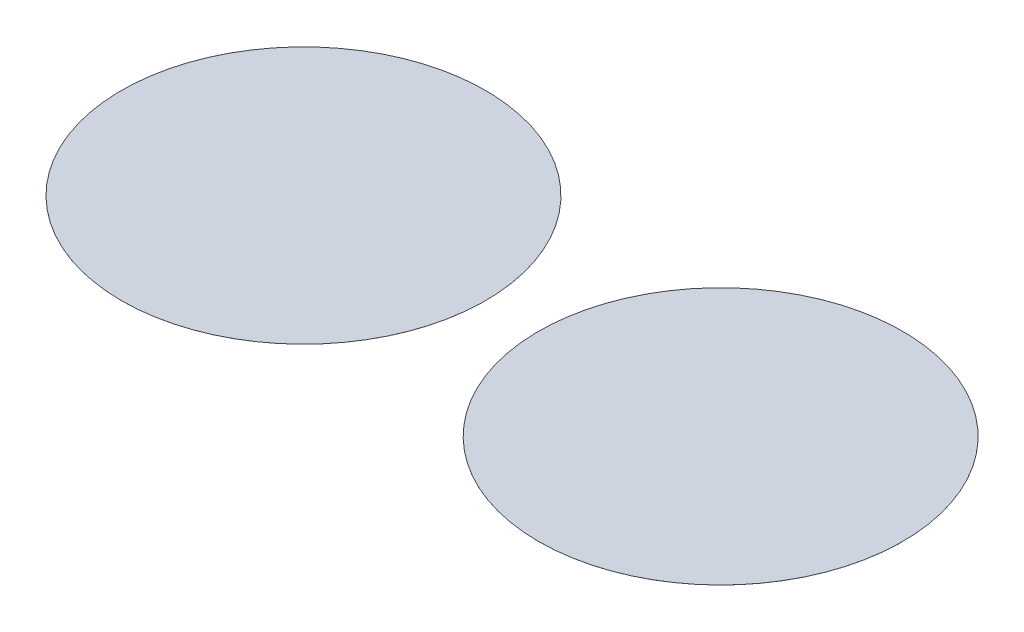
ISO-10303-21;
HEADER;
FILE_DESCRIPTION(('STEP AP214'),'2;1');
FILE_NAME('part.step','',(''),(''),'','','');
FILE_SCHEMA(('AUTOMOTIVE_DESIGN { 1 0 10303 214 1 1 1 1 }'));
ENDSEC;
DATA;
#1=APPLICATION_CONTEXT('core data for automotive mechanical design processes');
#2=APPLICATION_PROTOCOL_DEFINITION('international standard','automotive_design',2000,#1);
#3=PRODUCT_CONTEXT('',#1,'mechanical');
#4=PRODUCT('Part','Part','',(#3));
#5=PRODUCT_RELATED_PRODUCT_CATEGORY('part','',(#4));
#6=PRODUCT_DEFINITION_FORMATION('','',#4);
#7=PRODUCT_DEFINITION_CONTEXT('part definition',#1,'design');
#8=PRODUCT_DEFINITION('design','',#6,#7);
#9=PRODUCT_DEFINITION_SHAPE('','',#8);
#10=(LENGTH_UNIT() NAMED_UNIT(*) SI_UNIT(.MILLI.,.METRE.));
#11=(NAMED_UNIT(*) PLANE_ANGLE_UNIT() SI_UNIT($,.RADIAN.));
#12=(NAMED_UNIT(*) SI_UNIT($,.STERADIAN.) SOLID_ANGLE_UNIT());
#13=UNCERTAINTY_MEASURE_WITH_UNIT(LENGTH_MEASURE(1.E-05),#10,'distance_accuracy_value','');
#14=(GEOMETRIC_REPRESENTATION_CONTEXT(3) GLOBAL_UNCERTAINTY_ASSIGNED_CONTEXT((#13)) GLOBAL_UNIT_ASSIGNED_CONTEXT((#10,
#11,#12)) REPRESENTATION_CONTEXT('',''));
#15=CARTESIAN_POINT('',(0.,0.,0.));
#16=DIRECTION('',(0.,0.,1.));
#17=DIRECTION('',(1.,0.,0.));
#18=AXIS2_PLACEMENT_3D('',#15,#16,#17);
#19=CARTESIAN_POINT('',(5155.,0.5,0.));
#20=DIRECTION('',(0.,-1.,0.));
#21=DIRECTION('',(0.,0.,-1.));
#22=AXIS2_PLACEMENT_3D('',#19,#20,#21);
#23=CYLINDRICAL_SURFACE('',#22,4500.);
#24=CARTESIAN_POINT('',(5155.,0.5,0.));
#25=DIRECTION('',(0.,1.,0.));
#26=DIRECTION('',(0.,0.,1.));
#27=AXIS2_PLACEMENT_3D('',#24,#25,#26);
#28=CIRCLE('',#27,4500.);
#29=CARTESIAN_POINT('',(5155.,0.5,4500.));
#30=VERTEX_POINT('',#29);
#31=EDGE_CURVE('E11',#30,#30,#28,.T.);
#32=ORIENTED_EDGE('',*,*,#31,.F.);
#33=EDGE_LOOP('',(#32));
#34=FACE_BOUND('',#33,.T.);
#35=CARTESIAN_POINT('',(5155.,0.,0.));
#36=DIRECTION('',(0.,1.,0.));
#37=DIRECTION('',(0.,0.,1.));
#38=AXIS2_PLACEMENT_3D('',#35,#36,#37);
#39=CIRCLE('',#38,4500.);
#40=CARTESIAN_POINT('',(5155.,0.,4500.));
#41=VERTEX_POINT('',#40);
#42=EDGE_CURVE('E42',#41,#41,#39,.T.);
#43=ORIENTED_EDGE('',*,*,#42,.T.);
#44=EDGE_LOOP('',(#43));
#45=FACE_BOUND('',#44,.T.);
#46=ADVANCED_FACE('F39',(#34,#45),#23,.T.);
#47=CARTESIAN_POINT('',(5155.,0.5,0.));
#48=DIRECTION('',(0.,1.,0.));
#49=DIRECTION('',(0.,0.,1.));
#50=AXIS2_PLACEMENT_3D('',#47,#48,#49);
#51=PLANE('',#50);
#52=ORIENTED_EDGE('',*,*,#31,.T.);
#53=EDGE_LOOP('',(#52));
#54=FACE_BOUND('',#53,.T.);
#55=ADVANCED_FACE('F54',(#54),#51,.T.);
#56=CARTESIAN_POINT('',(5155.,0.,0.));
#57=DIRECTION('',(0.,1.,0.));
#58=DIRECTION('',(0.,0.,1.));
#59=AXIS2_PLACEMENT_3D('',#56,#57,#58);
#60=PLANE('',#59);
#61=ORIENTED_EDGE('',*,*,#42,.F.);
#62=EDGE_LOOP('',(#61));
#63=FACE_BOUND('',#62,.T.);
#64=ADVANCED_FACE('F52',(#63),#60,.F.);
#65=CLOSED_SHELL('',(#46,#55,#64));
#66=MANIFOLD_SOLID_BREP('B2',#65);
#67=CARTESIAN_POINT('',(-5155.,0.5,0.));
#68=DIRECTION('',(0.,-1.,0.));
#69=DIRECTION('',(0.,0.,-1.));
#70=AXIS2_PLACEMENT_3D('',#67,#68,#69);
#71=CYLINDRICAL_SURFACE('',#70,4500.);
#72=CARTESIAN_POINT('',(-5155.,0.5,0.));
#73=DIRECTION('',(0.,1.,0.));
#74=DIRECTION('',(0.,0.,1.));
#75=AXIS2_PLACEMENT_3D('',#72,#73,#74);
#76=CIRCLE('',#75,4500.);
#77=CARTESIAN_POINT('',(-5155.,0.5,4500.));
#78=VERTEX_POINT('',#77);
#79=EDGE_CURVE('E38',#78,#78,#76,.T.);
#80=ORIENTED_EDGE('',*,*,#79,.F.);
#81=EDGE_LOOP('',(#80));
#82=FACE_BOUND('',#81,.T.);
#83=CARTESIAN_POINT('',(-5155.,0.,0.));
#84=DIRECTION('',(0.,1.,0.));
#85=DIRECTION('',(0.,0.,1.));
#86=AXIS2_PLACEMENT_3D('',#83,#84,#85);
#87=CIRCLE('',#86,4500.);
#88=CARTESIAN_POINT('',(-5155.,0.,4500.));
#89=VERTEX_POINT('',#88);
#90=EDGE_CURVE('E83',#89,#89,#87,.T.);
#91=ORIENTED_EDGE('',*,*,#90,.T.);
#92=EDGE_LOOP('',(#91));
#93=FACE_BOUND('',#92,.T.);
#94=ADVANCED_FACE('F80',(#82,#93),#71,.T.);
#95=CARTESIAN_POINT('',(-5155.,0.5,0.));
#96=DIRECTION('',(0.,1.,0.));
#97=DIRECTION('',(0.,0.,1.));
#98=AXIS2_PLACEMENT_3D('',#95,#96,#97);
#99=PLANE('',#98);
#100=ORIENTED_EDGE('',*,*,#79,.T.);
#101=EDGE_LOOP('',(#100));
#102=FACE_BOUND('',#101,.T.);
#103=ADVANCED_FACE('F95',(#102),#99,.T.);
#104=CARTESIAN_POINT('',(-5155.,0.,0.));
#105=DIRECTION('',(0.,1.,0.));
#106=DIRECTION('',(0.,0.,1.));
#107=AXIS2_PLACEMENT_3D('',#104,#105,#106);
#108=PLANE('',#107);
#109=ORIENTED_EDGE('',*,*,#90,.F.);
#110=EDGE_LOOP('',(#109));
#111=FACE_BOUND('',#110,.T.);
#112=ADVANCED_FACE('F93',(#111),#108,.F.);
#113=CLOSED_SHELL('',(#94,#103,#112));
#114=MANIFOLD_SOLID_BREP('B6',#113);
#115=ADVANCED_BREP_SHAPE_REPRESENTATION('',(#18,#66,#114),#14);
#116=SHAPE_DEFINITION_REPRESENTATION(#9,#115);
ENDSEC;
END-ISO-10303-21;
